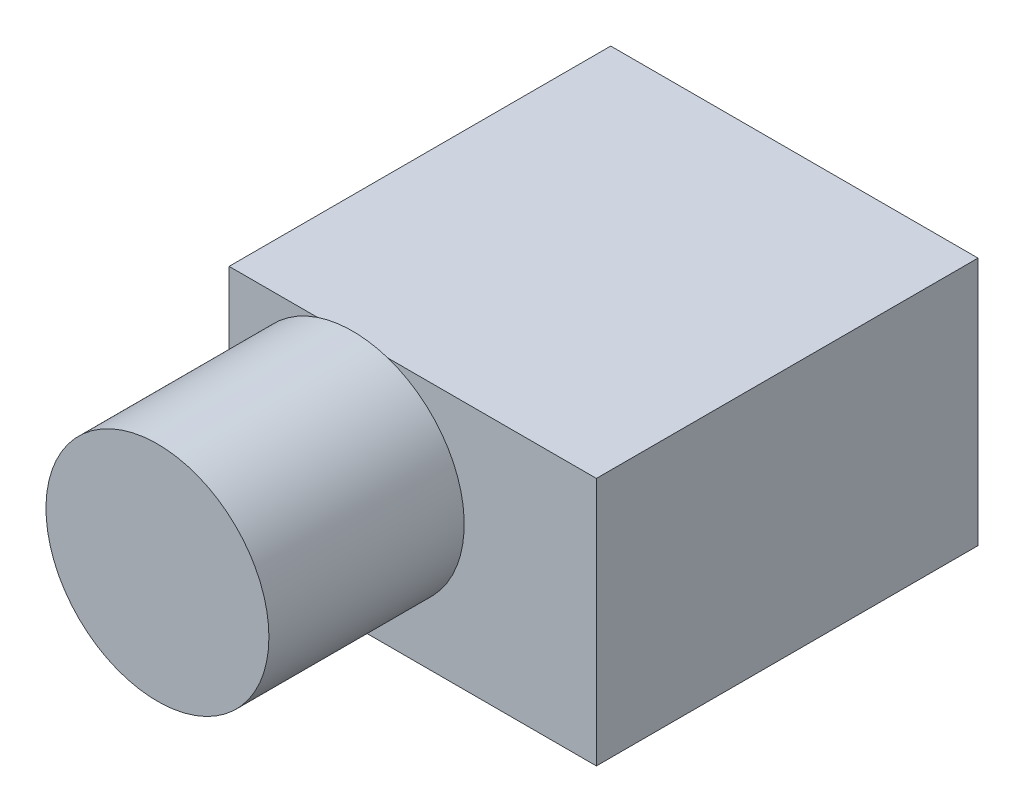
ISO-10303-21;
HEADER;
FILE_DESCRIPTION(('STEP AP214'),'2;1');
FILE_NAME('part.step','',(''),(''),'','','');
FILE_SCHEMA(('AUTOMOTIVE_DESIGN { 1 0 10303 214 1 1 1 1 }'));
ENDSEC;
DATA;
#1=APPLICATION_CONTEXT('core data for automotive mechanical design processes');
#2=APPLICATION_PROTOCOL_DEFINITION('international standard','automotive_design',2000,#1);
#3=PRODUCT_CONTEXT('',#1,'mechanical');
#4=PRODUCT('Part','Part','',(#3));
#5=PRODUCT_RELATED_PRODUCT_CATEGORY('part','',(#4));
#6=PRODUCT_DEFINITION_FORMATION('','',#4);
#7=PRODUCT_DEFINITION_CONTEXT('part definition',#1,'design');
#8=PRODUCT_DEFINITION('design','',#6,#7);
#9=PRODUCT_DEFINITION_SHAPE('','',#8);
#10=(LENGTH_UNIT() NAMED_UNIT(*) SI_UNIT(.MILLI.,.METRE.));
#11=(NAMED_UNIT(*) PLANE_ANGLE_UNIT() SI_UNIT($,.RADIAN.));
#12=(NAMED_UNIT(*) SI_UNIT($,.STERADIAN.) SOLID_ANGLE_UNIT());
#13=UNCERTAINTY_MEASURE_WITH_UNIT(LENGTH_MEASURE(1.E-05),#10,'distance_accuracy_value','');
#14=(GEOMETRIC_REPRESENTATION_CONTEXT(3) GLOBAL_UNCERTAINTY_ASSIGNED_CONTEXT((#13)) GLOBAL_UNIT_ASSIGNED_CONTEXT((#10,
#11,#12)) REPRESENTATION_CONTEXT('',''));
#15=CARTESIAN_POINT('',(0.,0.,0.));
#16=DIRECTION('',(0.,0.,1.));
#17=DIRECTION('',(1.,0.,0.));
#18=AXIS2_PLACEMENT_3D('',#15,#16,#17);
#19=CARTESIAN_POINT('',(-10.25,13.9,10.65));
#20=DIRECTION('',(0.,0.,-1.));
#21=DIRECTION('',(-1.,0.,0.));
#22=AXIS2_PLACEMENT_3D('',#19,#20,#21);
#23=PLANE('',#22);
#24=CARTESIAN_POINT('',(-3.34979177925732,7.99622762171737,10.65));
#25=DIRECTION('',(0.,0.,1.));
#26=DIRECTION('',(1.,0.,0.));
#27=AXIS2_PLACEMENT_3D('',#24,#25,#26);
#28=CIRCLE('',#27,6.2219895679233);
#29=CARTESIAN_POINT('',(-5.31413031646861,13.9,10.65));
#30=VERTEX_POINT('',#29);
#31=CARTESIAN_POINT('',(-1.38545324204602,13.9,10.65));
#32=VERTEX_POINT('',#31);
#33=EDGE_CURVE('E11',#30,#32,#28,.T.);
#34=ORIENTED_EDGE('',*,*,#33,.F.);
#35=DIRECTION('',(1.,0.,0.));
#36=VECTOR('',#35,1.);
#37=CARTESIAN_POINT('',(-10.25,13.9,10.65));
#38=LINE('',#37,#36);
#39=CARTESIAN_POINT('',(-10.25,13.9,10.65));
#40=VERTEX_POINT('',#39);
#41=EDGE_CURVE('E90',#40,#30,#38,.T.);
#42=ORIENTED_EDGE('',*,*,#41,.F.);
#43=DIRECTION('',(0.,-1.,0.));
#44=VECTOR('',#43,1.);
#45=CARTESIAN_POINT('',(-10.25,13.9,10.65));
#46=LINE('',#45,#44);
#47=CARTESIAN_POINT('',(-10.25,0.,10.65));
#48=VERTEX_POINT('',#47);
#49=EDGE_CURVE('E118',#40,#48,#46,.T.);
#50=ORIENTED_EDGE('',*,*,#49,.T.);
#51=DIRECTION('',(1.,0.,0.));
#52=VECTOR('',#51,1.);
#53=CARTESIAN_POINT('',(-10.25,0.,10.65));
#54=LINE('',#53,#52);
#55=CARTESIAN_POINT('',(10.25,0.,10.65));
#56=VERTEX_POINT('',#55);
#57=EDGE_CURVE('E77',#48,#56,#54,.T.);
#58=ORIENTED_EDGE('',*,*,#57,.T.);
#59=DIRECTION('',(0.,-1.,0.));
#60=VECTOR('',#59,1.);
#61=CARTESIAN_POINT('',(10.25,13.9,10.65));
#62=LINE('',#61,#60);
#63=CARTESIAN_POINT('',(10.25,13.9,10.65));
#64=VERTEX_POINT('',#63);
#65=EDGE_CURVE('E95',#64,#56,#62,.T.);
#66=ORIENTED_EDGE('',*,*,#65,.F.);
#67=EDGE_CURVE('E56',#32,#64,#38,.T.);
#68=ORIENTED_EDGE('',*,*,#67,.F.);
#69=EDGE_LOOP('',(#34,#42,#50,#58,#66,#68));
#70=FACE_BOUND('',#69,.T.);
#71=ADVANCED_FACE('F33',(#70),#23,.F.);
#72=CARTESIAN_POINT('',(10.25,13.9,10.65));
#73=DIRECTION('',(-1.,0.,0.));
#74=DIRECTION('',(0.,0.,1.));
#75=AXIS2_PLACEMENT_3D('',#72,#73,#74);
#76=PLANE('',#75);
#77=DIRECTION('',(0.,0.,-1.));
#78=VECTOR('',#77,1.);
#79=CARTESIAN_POINT('',(10.25,0.,10.65));
#80=LINE('',#79,#78);
#81=CARTESIAN_POINT('',(10.25,0.,-10.65));
#82=VERTEX_POINT('',#81);
#83=EDGE_CURVE('E103',#56,#82,#80,.T.);
#84=ORIENTED_EDGE('',*,*,#83,.T.);
#85=DIRECTION('',(0.,-1.,0.));
#86=VECTOR('',#85,1.);
#87=CARTESIAN_POINT('',(10.25,13.9,-10.65));
#88=LINE('',#87,#86);
#89=CARTESIAN_POINT('',(10.25,13.9,-10.65));
#90=VERTEX_POINT('',#89);
#91=EDGE_CURVE('E37',#90,#82,#88,.T.);
#92=ORIENTED_EDGE('',*,*,#91,.F.);
#93=DIRECTION('',(0.,0.,-1.));
#94=VECTOR('',#93,1.);
#95=CARTESIAN_POINT('',(10.25,13.9,10.65));
#96=LINE('',#95,#94);
#97=EDGE_CURVE('E106',#64,#90,#96,.T.);
#98=ORIENTED_EDGE('',*,*,#97,.F.);
#99=ORIENTED_EDGE('',*,*,#65,.T.);
#100=EDGE_LOOP('',(#84,#92,#98,#99));
#101=FACE_BOUND('',#100,.T.);
#102=ADVANCED_FACE('F35',(#101),#76,.F.);
#103=CARTESIAN_POINT('',(-10.25,13.9,-10.65));
#104=DIRECTION('',(0.,0.,1.));
#105=DIRECTION('',(1.,0.,0.));
#106=AXIS2_PLACEMENT_3D('',#103,#104,#105);
#107=PLANE('',#106);
#108=DIRECTION('',(-1.,0.,0.));
#109=VECTOR('',#108,1.);
#110=CARTESIAN_POINT('',(-10.25,0.,-10.65));
#111=LINE('',#110,#109);
#112=CARTESIAN_POINT('',(-10.25,0.,-10.65));
#113=VERTEX_POINT('',#112);
#114=EDGE_CURVE('E112',#82,#113,#111,.T.);
#115=ORIENTED_EDGE('',*,*,#114,.T.);
#116=DIRECTION('',(0.,-1.,0.));
#117=VECTOR('',#116,1.);
#118=CARTESIAN_POINT('',(-10.25,13.9,-10.65));
#119=LINE('',#118,#117);
#120=CARTESIAN_POINT('',(-10.25,13.9,-10.65));
#121=VERTEX_POINT('',#120);
#122=EDGE_CURVE('E119',#121,#113,#119,.T.);
#123=ORIENTED_EDGE('',*,*,#122,.F.);
#124=DIRECTION('',(-1.,0.,0.));
#125=VECTOR('',#124,1.);
#126=CARTESIAN_POINT('',(-10.25,13.9,-10.65));
#127=LINE('',#126,#125);
#128=EDGE_CURVE('E85',#90,#121,#127,.T.);
#129=ORIENTED_EDGE('',*,*,#128,.F.);
#130=ORIENTED_EDGE('',*,*,#91,.T.);
#131=EDGE_LOOP('',(#115,#123,#129,#130));
#132=FACE_BOUND('',#131,.T.);
#133=ADVANCED_FACE('F125',(#132),#107,.F.);
#134=CARTESIAN_POINT('',(-10.25,13.9,10.65));
#135=DIRECTION('',(1.,0.,0.));
#136=DIRECTION('',(0.,0.,-1.));
#137=AXIS2_PLACEMENT_3D('',#134,#135,#136);
#138=PLANE('',#137);
#139=DIRECTION('',(0.,0.,1.));
#140=VECTOR('',#139,1.);
#141=CARTESIAN_POINT('',(-10.25,0.,10.65));
#142=LINE('',#141,#140);
#143=EDGE_CURVE('E114',#113,#48,#142,.T.);
#144=ORIENTED_EDGE('',*,*,#143,.T.);
#145=ORIENTED_EDGE('',*,*,#49,.F.);
#146=DIRECTION('',(0.,0.,1.));
#147=VECTOR('',#146,1.);
#148=CARTESIAN_POINT('',(-10.25,13.9,10.65));
#149=LINE('',#148,#147);
#150=EDGE_CURVE('E97',#121,#40,#149,.T.);
#151=ORIENTED_EDGE('',*,*,#150,.F.);
#152=ORIENTED_EDGE('',*,*,#122,.T.);
#153=EDGE_LOOP('',(#144,#145,#151,#152));
#154=FACE_BOUND('',#153,.T.);
#155=ADVANCED_FACE('F131',(#154),#138,.F.);
#156=CARTESIAN_POINT('',(0.,13.9,0.));
#157=DIRECTION('',(0.,-1.,0.));
#158=DIRECTION('',(0.,0.,-1.));
#159=AXIS2_PLACEMENT_3D('',#156,#157,#158);
#160=PLANE('',#159);
#161=ORIENTED_EDGE('',*,*,#97,.T.);
#162=ORIENTED_EDGE('',*,*,#128,.T.);
#163=ORIENTED_EDGE('',*,*,#150,.T.);
#164=ORIENTED_EDGE('',*,*,#41,.T.);
#165=EDGE_CURVE('E88',#30,#32,#38,.T.);
#166=ORIENTED_EDGE('',*,*,#165,.T.);
#167=ORIENTED_EDGE('',*,*,#67,.T.);
#168=EDGE_LOOP('',(#161,#162,#163,#164,#166,#167));
#169=FACE_BOUND('',#168,.T.);
#170=ADVANCED_FACE('F89',(#169),#160,.F.);
#171=CARTESIAN_POINT('',(0.,0.,0.));
#172=DIRECTION('',(0.,-1.,0.));
#173=DIRECTION('',(0.,0.,-1.));
#174=AXIS2_PLACEMENT_3D('',#171,#172,#173);
#175=PLANE('',#174);
#176=ORIENTED_EDGE('',*,*,#83,.F.);
#177=ORIENTED_EDGE('',*,*,#57,.F.);
#178=ORIENTED_EDGE('',*,*,#143,.F.);
#179=ORIENTED_EDGE('',*,*,#114,.F.);
#180=EDGE_LOOP('',(#176,#177,#178,#179));
#181=FACE_BOUND('',#180,.T.);
#182=ADVANCED_FACE('F129',(#181),#175,.T.);
#183=CARTESIAN_POINT('',(-3.34979177925732,7.99622762171737,21.55));
#184=DIRECTION('',(0.,0.,-1.));
#185=DIRECTION('',(-1.,0.,0.));
#186=AXIS2_PLACEMENT_3D('',#183,#184,#185);
#187=CYLINDRICAL_SURFACE('',#186,6.2219895679233);
#188=CARTESIAN_POINT('',(-3.34979177925732,7.99622762171737,21.55));
#189=DIRECTION('',(0.,0.,1.));
#190=DIRECTION('',(1.,0.,0.));
#191=AXIS2_PLACEMENT_3D('',#188,#189,#190);
#192=CIRCLE('',#191,6.2219895679233);
#193=CARTESIAN_POINT('',(2.87219778866599,7.99622762171737,21.55));
#194=VERTEX_POINT('',#193);
#195=EDGE_CURVE('E101',#194,#194,#192,.T.);
#196=ORIENTED_EDGE('',*,*,#195,.F.);
#197=EDGE_LOOP('',(#196));
#198=FACE_BOUND('',#197,.T.);
#199=EDGE_CURVE('E43',#32,#30,#28,.T.);
#200=ORIENTED_EDGE('',*,*,#199,.T.);
#201=ORIENTED_EDGE('',*,*,#33,.T.);
#202=EDGE_LOOP('',(#200,#201));
#203=FACE_BOUND('',#202,.T.);
#204=ADVANCED_FACE('F99',(#198,#203),#187,.T.);
#205=CARTESIAN_POINT('',(-3.34979177925732,7.99622762171737,21.55));
#206=DIRECTION('',(0.,0.,1.));
#207=DIRECTION('',(1.,0.,0.));
#208=AXIS2_PLACEMENT_3D('',#205,#206,#207);
#209=PLANE('',#208);
#210=ORIENTED_EDGE('',*,*,#195,.T.);
#211=EDGE_LOOP('',(#210));
#212=FACE_BOUND('',#211,.T.);
#213=ADVANCED_FACE('F149',(#212),#209,.T.);
#214=CARTESIAN_POINT('',(-3.34979177925732,7.99622762171737,10.65));
#215=DIRECTION('',(0.,0.,1.));
#216=DIRECTION('',(1.,0.,0.));
#217=AXIS2_PLACEMENT_3D('',#214,#215,#216);
#218=PLANE('',#217);
#219=ORIENTED_EDGE('',*,*,#165,.F.);
#220=ORIENTED_EDGE('',*,*,#199,.F.);
#221=EDGE_LOOP('',(#219,#220));
#222=FACE_BOUND('',#221,.T.);
#223=ADVANCED_FACE('F100',(#222),#218,.F.);
#224=CLOSED_SHELL('',(#71,#102,#133,#155,#170,#182,#204,#213,#223));
#225=MANIFOLD_SOLID_BREP('B2',#224);
#226=ADVANCED_BREP_SHAPE_REPRESENTATION('',(#18,#225),#14);
#227=SHAPE_DEFINITION_REPRESENTATION(#9,#226);
ENDSEC;
END-ISO-10303-21;
